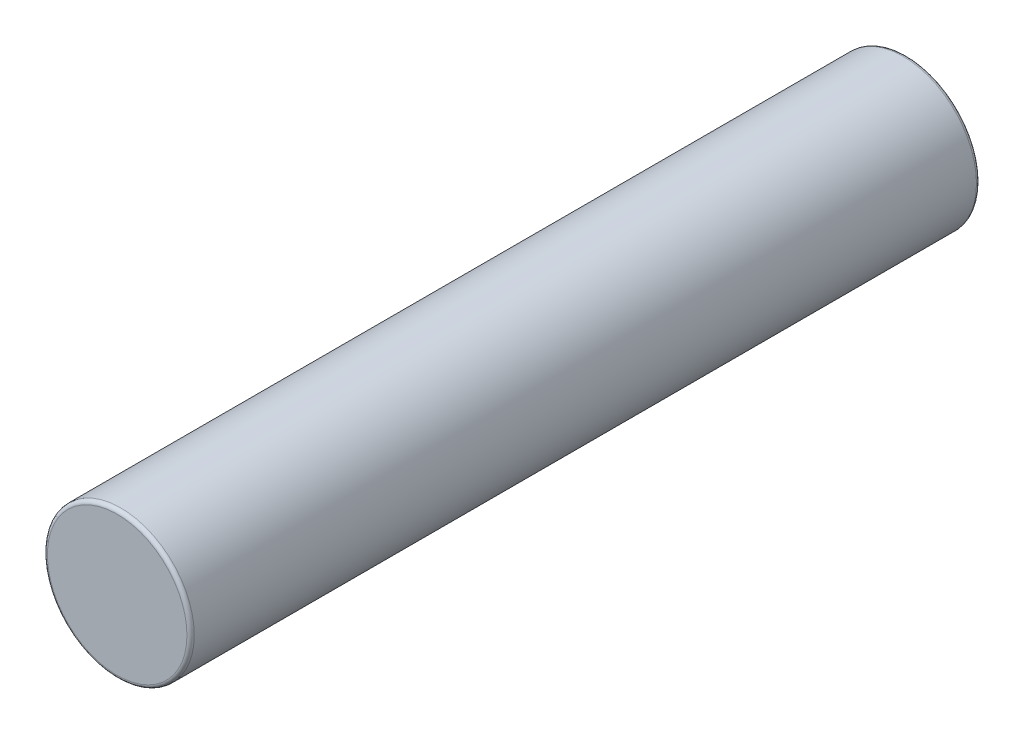
ISO-10303-21;
HEADER;
FILE_DESCRIPTION(('STEP AP214'),'2;1');
FILE_NAME('part.step','',(''),(''),'','','');
FILE_SCHEMA(('AUTOMOTIVE_DESIGN { 1 0 10303 214 1 1 1 1 }'));
ENDSEC;
DATA;
#1=APPLICATION_CONTEXT('core data for automotive mechanical design processes');
#2=APPLICATION_PROTOCOL_DEFINITION('international standard','automotive_design',2000,#1);
#3=PRODUCT_CONTEXT('',#1,'mechanical');
#4=PRODUCT('Part','Part','',(#3));
#5=PRODUCT_RELATED_PRODUCT_CATEGORY('part','',(#4));
#6=PRODUCT_DEFINITION_FORMATION('','',#4);
#7=PRODUCT_DEFINITION_CONTEXT('part definition',#1,'design');
#8=PRODUCT_DEFINITION('design','',#6,#7);
#9=PRODUCT_DEFINITION_SHAPE('','',#8);
#10=(LENGTH_UNIT() NAMED_UNIT(*) SI_UNIT(.MILLI.,.METRE.));
#11=(NAMED_UNIT(*) PLANE_ANGLE_UNIT() SI_UNIT($,.RADIAN.));
#12=(NAMED_UNIT(*) SI_UNIT($,.STERADIAN.) SOLID_ANGLE_UNIT());
#13=UNCERTAINTY_MEASURE_WITH_UNIT(LENGTH_MEASURE(1.E-05),#10,'distance_accuracy_value','');
#14=(GEOMETRIC_REPRESENTATION_CONTEXT(3) GLOBAL_UNCERTAINTY_ASSIGNED_CONTEXT((#13)) GLOBAL_UNIT_ASSIGNED_CONTEXT((#10,
#11,#12)) REPRESENTATION_CONTEXT('',''));
#15=CARTESIAN_POINT('',(0.,0.,0.));
#16=DIRECTION('',(0.,0.,1.));
#17=DIRECTION('',(1.,0.,0.));
#18=AXIS2_PLACEMENT_3D('',#15,#16,#17);
#19=CARTESIAN_POINT('',(0.,0.,21.5));
#20=DIRECTION('',(0.,0.,-1.));
#21=DIRECTION('',(-1.,0.,0.));
#22=AXIS2_PLACEMENT_3D('',#19,#20,#21);
#23=CYLINDRICAL_SURFACE('',#22,2.);
#24=CARTESIAN_POINT('',(0.,0.,21.4));
#25=DIRECTION('',(0.,0.,1.));
#26=DIRECTION('',(1.,0.,0.));
#27=AXIS2_PLACEMENT_3D('',#24,#25,#26);
#28=CIRCLE('',#27,2.);
#29=CARTESIAN_POINT('',(2.,0.,21.4));
#30=VERTEX_POINT('',#29);
#31=EDGE_CURVE('E45',#30,#30,#28,.F.);
#32=ORIENTED_EDGE('',*,*,#31,.T.);
#33=EDGE_LOOP('',(#32));
#34=FACE_BOUND('',#33,.T.);
#35=CARTESIAN_POINT('',(0.,0.,0.0999999999999994));
#36=DIRECTION('',(0.,0.,1.));
#37=DIRECTION('',(1.,0.,0.));
#38=AXIS2_PLACEMENT_3D('',#35,#36,#37);
#39=CIRCLE('',#38,2.);
#40=CARTESIAN_POINT('',(2.,0.,0.0999999999999994));
#41=VERTEX_POINT('',#40);
#42=EDGE_CURVE('E50',#41,#41,#39,.T.);
#43=ORIENTED_EDGE('',*,*,#42,.T.);
#44=EDGE_LOOP('',(#43));
#45=FACE_BOUND('',#44,.T.);
#46=ADVANCED_FACE('F37',(#34,#45),#23,.T.);
#47=CARTESIAN_POINT('',(0.,0.,21.5));
#48=DIRECTION('',(0.,0.,1.));
#49=DIRECTION('',(1.,0.,0.));
#50=AXIS2_PLACEMENT_3D('',#47,#48,#49);
#51=PLANE('',#50);
#52=CARTESIAN_POINT('',(0.,0.,21.5));
#53=DIRECTION('',(0.,0.,1.));
#54=DIRECTION('',(1.,0.,0.));
#55=AXIS2_PLACEMENT_3D('',#52,#53,#54);
#56=CIRCLE('',#55,1.9);
#57=CARTESIAN_POINT('',(1.9,0.,21.5));
#58=VERTEX_POINT('',#57);
#59=EDGE_CURVE('E55',#58,#58,#56,.T.);
#60=ORIENTED_EDGE('',*,*,#59,.T.);
#61=EDGE_LOOP('',(#60));
#62=FACE_BOUND('',#61,.T.);
#63=ADVANCED_FACE('F62',(#62),#51,.T.);
#64=CARTESIAN_POINT('',(0.,0.,0.));
#65=DIRECTION('',(0.,0.,1.));
#66=DIRECTION('',(1.,0.,0.));
#67=AXIS2_PLACEMENT_3D('',#64,#65,#66);
#68=PLANE('',#67);
#69=CARTESIAN_POINT('',(0.,0.,0.));
#70=DIRECTION('',(0.,0.,1.));
#71=DIRECTION('',(1.,0.,0.));
#72=AXIS2_PLACEMENT_3D('',#69,#70,#71);
#73=CIRCLE('',#72,1.9);
#74=CARTESIAN_POINT('',(1.9,0.,0.));
#75=VERTEX_POINT('',#74);
#76=EDGE_CURVE('E10',#75,#75,#73,.F.);
#77=ORIENTED_EDGE('',*,*,#76,.T.);
#78=EDGE_LOOP('',(#77));
#79=FACE_BOUND('',#78,.T.);
#80=ADVANCED_FACE('F66',(#79),#68,.F.);
#81=CARTESIAN_POINT('',(0.,0.,21.4));
#82=DIRECTION('',(0.,0.,1.));
#83=DIRECTION('',(1.,0.,0.));
#84=AXIS2_PLACEMENT_3D('',#81,#82,#83);
#85=TOROIDAL_SURFACE('',#84,1.9,0.1);
#86=ORIENTED_EDGE('',*,*,#31,.F.);
#87=EDGE_LOOP('',(#86));
#88=FACE_BOUND('',#87,.T.);
#89=ORIENTED_EDGE('',*,*,#59,.F.);
#90=EDGE_LOOP('',(#89));
#91=FACE_BOUND('',#90,.T.);
#92=ADVANCED_FACE('F64',(#88,#91),#85,.T.);
#93=CARTESIAN_POINT('',(0.,0.,0.0999999999999994));
#94=DIRECTION('',(0.,0.,1.));
#95=DIRECTION('',(1.,0.,0.));
#96=AXIS2_PLACEMENT_3D('',#93,#94,#95);
#97=TOROIDAL_SURFACE('',#96,1.9,0.1);
#98=ORIENTED_EDGE('',*,*,#76,.F.);
#99=EDGE_LOOP('',(#98));
#100=FACE_BOUND('',#99,.T.);
#101=ORIENTED_EDGE('',*,*,#42,.F.);
#102=EDGE_LOOP('',(#101));
#103=FACE_BOUND('',#102,.T.);
#104=ADVANCED_FACE('F39',(#100,#103),#97,.T.);
#105=CLOSED_SHELL('',(#46,#63,#80,#92,#104));
#106=MANIFOLD_SOLID_BREP('B2',#105);
#107=ADVANCED_BREP_SHAPE_REPRESENTATION('',(#18,#106),#14);
#108=SHAPE_DEFINITION_REPRESENTATION(#9,#107);
ENDSEC;
END-ISO-10303-21;
